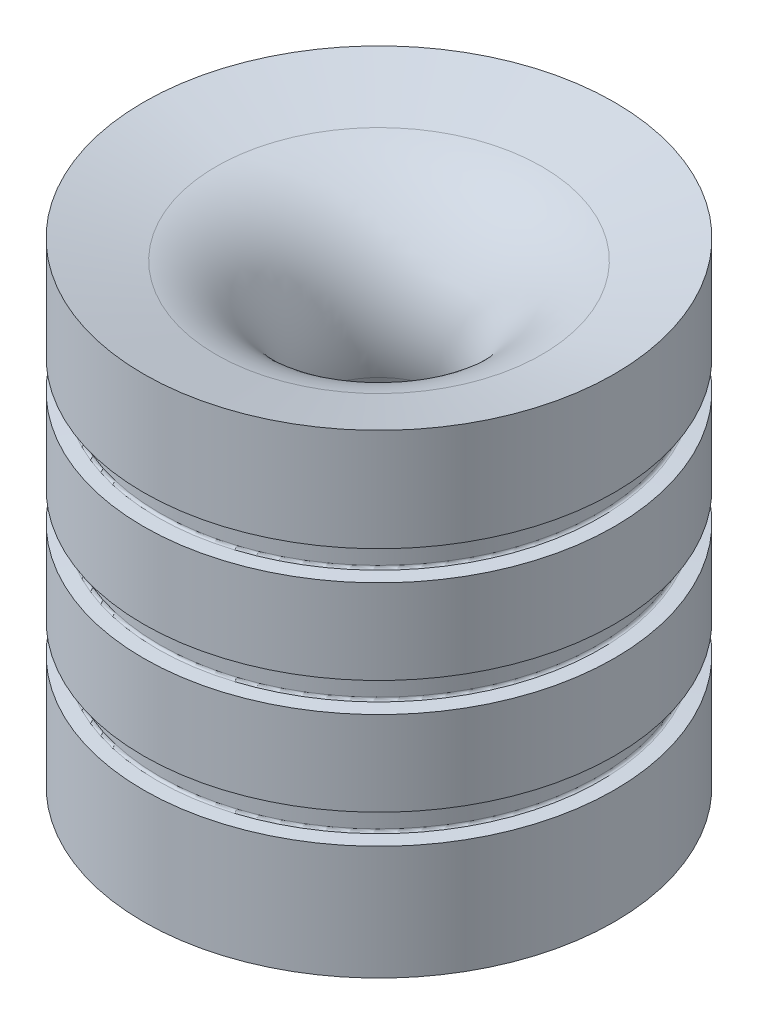
ISO-10303-21;
HEADER;
FILE_DESCRIPTION(('STEP AP214'),'2;1');
FILE_NAME('part.step','',(''),(''),'','','');
FILE_SCHEMA(('AUTOMOTIVE_DESIGN { 1 0 10303 214 1 1 1 1 }'));
ENDSEC;
DATA;
#1=APPLICATION_CONTEXT('core data for automotive mechanical design processes');
#2=APPLICATION_PROTOCOL_DEFINITION('international standard','automotive_design',2000,#1);
#3=PRODUCT_CONTEXT('',#1,'mechanical');
#4=PRODUCT('Part','Part','',(#3));
#5=PRODUCT_RELATED_PRODUCT_CATEGORY('part','',(#4));
#6=PRODUCT_DEFINITION_FORMATION('','',#4);
#7=PRODUCT_DEFINITION_CONTEXT('part definition',#1,'design');
#8=PRODUCT_DEFINITION('design','',#6,#7);
#9=PRODUCT_DEFINITION_SHAPE('','',#8);
#10=(LENGTH_UNIT() NAMED_UNIT(*) SI_UNIT(.MILLI.,.METRE.));
#11=(NAMED_UNIT(*) PLANE_ANGLE_UNIT() SI_UNIT($,.RADIAN.));
#12=(NAMED_UNIT(*) SI_UNIT($,.STERADIAN.) SOLID_ANGLE_UNIT());
#13=UNCERTAINTY_MEASURE_WITH_UNIT(LENGTH_MEASURE(1.E-05),#10,'distance_accuracy_value','');
#14=(GEOMETRIC_REPRESENTATION_CONTEXT(3) GLOBAL_UNCERTAINTY_ASSIGNED_CONTEXT((#13)) GLOBAL_UNIT_ASSIGNED_CONTEXT((#10,
#11,#12)) REPRESENTATION_CONTEXT('',''));
#15=CARTESIAN_POINT('',(0.,0.,0.));
#16=DIRECTION('',(0.,0.,1.));
#17=DIRECTION('',(1.,0.,0.));
#18=AXIS2_PLACEMENT_3D('',#15,#16,#17);
#19=CARTESIAN_POINT('',(0.,11.2038865741592,0.));
#20=DIRECTION('',(0.,-1.,0.));
#21=DIRECTION('',(0.,0.,-1.));
#22=AXIS2_PLACEMENT_3D('',#19,#20,#21);
#23=CYLINDRICAL_SURFACE('',#22,41.275);
#24=CARTESIAN_POINT('',(0.,60.0077777421875,0.));
#25=DIRECTION('',(0.,-1.,0.));
#26=DIRECTION('',(0.,0.,-1.));
#27=AXIS2_PLACEMENT_3D('',#24,#25,#26);
#28=CIRCLE('',#27,41.275);
#29=CARTESIAN_POINT('',(0.,60.0077777421875,-41.275));
#30=VERTEX_POINT('',#29);
#31=EDGE_CURVE('E40',#30,#30,#28,.F.);
#32=ORIENTED_EDGE('',*,*,#31,.F.);
#33=EDGE_LOOP('',(#32));
#34=FACE_BOUND('',#33,.T.);
#35=CARTESIAN_POINT('',(0.,45.1799101451754,0.));
#36=DIRECTION('',(0.,1.,0.));
#37=DIRECTION('',(0.,0.,1.));
#38=AXIS2_PLACEMENT_3D('',#35,#36,#37);
#39=CIRCLE('',#38,41.275);
#40=CARTESIAN_POINT('',(0.,45.1799101451754,41.275));
#41=VERTEX_POINT('',#40);
#42=EDGE_CURVE('E61',#41,#41,#39,.F.);
#43=ORIENTED_EDGE('',*,*,#42,.F.);
#44=EDGE_LOOP('',(#43));
#45=FACE_BOUND('',#44,.T.);
#46=ADVANCED_FACE('F36',(#34,#45),#23,.T.);
#47=CARTESIAN_POINT('',(0.,40.0077777421875,0.));
#48=DIRECTION('',(0.,-1.,0.));
#49=DIRECTION('',(0.,0.,-1.));
#50=AXIS2_PLACEMENT_3D('',#47,#48,#49);
#51=CIRCLE('',#50,41.275);
#52=CARTESIAN_POINT('',(0.,40.0077777421875,-41.275));
#53=VERTEX_POINT('',#52);
#54=EDGE_CURVE('E64',#53,#53,#51,.F.);
#55=ORIENTED_EDGE('',*,*,#54,.F.);
#56=EDGE_LOOP('',(#55));
#57=FACE_BOUND('',#56,.T.);
#58=CARTESIAN_POINT('',(0.,25.1799101451754,0.));
#59=DIRECTION('',(0.,1.,0.));
#60=DIRECTION('',(0.,0.,1.));
#61=AXIS2_PLACEMENT_3D('',#58,#59,#60);
#62=CIRCLE('',#61,41.275);
#63=CARTESIAN_POINT('',(0.,25.1799101451754,41.275));
#64=VERTEX_POINT('',#63);
#65=EDGE_CURVE('E53',#64,#64,#62,.F.);
#66=ORIENTED_EDGE('',*,*,#65,.F.);
#67=EDGE_LOOP('',(#66));
#68=FACE_BOUND('',#67,.T.);
#69=ADVANCED_FACE('F129',(#57,#68),#23,.T.);
#70=CARTESIAN_POINT('',(0.,20.0077777421875,0.));
#71=DIRECTION('',(0.,-1.,0.));
#72=DIRECTION('',(0.,0.,-1.));
#73=AXIS2_PLACEMENT_3D('',#70,#71,#72);
#74=CIRCLE('',#73,41.275);
#75=CARTESIAN_POINT('',(0.,20.0077777421875,-41.275));
#76=VERTEX_POINT('',#75);
#77=EDGE_CURVE('E56',#76,#76,#74,.F.);
#78=ORIENTED_EDGE('',*,*,#77,.F.);
#79=EDGE_LOOP('',(#78));
#80=FACE_BOUND('',#79,.T.);
#81=CARTESIAN_POINT('',(0.,0.,0.));
#82=DIRECTION('',(0.,-1.,0.));
#83=DIRECTION('',(0.,0.,-1.));
#84=AXIS2_PLACEMENT_3D('',#81,#82,#83);
#85=CIRCLE('',#84,41.275);
#86=CARTESIAN_POINT('',(0.,0.,-41.275));
#87=VERTEX_POINT('',#86);
#88=EDGE_CURVE('E44',#87,#87,#85,.T.);
#89=ORIENTED_EDGE('',*,*,#88,.F.);
#90=EDGE_LOOP('',(#89));
#91=FACE_BOUND('',#90,.T.);
#92=ADVANCED_FACE('F127',(#80,#91),#23,.T.);
#93=CARTESIAN_POINT('',(0.,83.16233102555,0.));
#94=DIRECTION('',(0.,1.,0.));
#95=DIRECTION('',(0.,0.,1.));
#96=AXIS2_PLACEMENT_3D('',#93,#94,#95);
#97=CONICAL_SURFACE('',#96,41.275,1.30899693899575);
#98=CARTESIAN_POINT('',(0.,79.7542801580591,0.));
#99=DIRECTION('',(0.,-1.,0.));
#100=DIRECTION('',(0.,0.,-1.));
#101=AXIS2_PLACEMENT_3D('',#98,#99,#100);
#102=CIRCLE('',#101,28.5559810077446);
#103=CARTESIAN_POINT('',(0.,79.7542801580591,-28.5559810077446));
#104=VERTEX_POINT('',#103);
#105=EDGE_CURVE('E60',#104,#104,#102,.T.);
#106=ORIENTED_EDGE('',*,*,#105,.T.);
#107=EDGE_LOOP('',(#106));
#108=FACE_BOUND('',#107,.T.);
#109=CARTESIAN_POINT('',(0.,83.16233102555,0.));
#110=DIRECTION('',(0.,-1.,0.));
#111=DIRECTION('',(0.,0.,-1.));
#112=AXIS2_PLACEMENT_3D('',#109,#110,#111);
#113=CIRCLE('',#112,41.275);
#114=CARTESIAN_POINT('',(0.,83.16233102555,-41.275));
#115=VERTEX_POINT('',#114);
#116=EDGE_CURVE('E10',#115,#115,#113,.T.);
#117=ORIENTED_EDGE('',*,*,#116,.F.);
#118=EDGE_LOOP('',(#117));
#119=FACE_BOUND('',#118,.T.);
#120=ADVANCED_FACE('F38',(#108,#119),#97,.F.);
#121=CARTESIAN_POINT('',(0.,65.1799101451754,0.));
#122=DIRECTION('',(0.,1.,0.));
#123=DIRECTION('',(0.,0.,1.));
#124=AXIS2_PLACEMENT_3D('',#121,#122,#123);
#125=CIRCLE('',#124,41.275);
#126=CARTESIAN_POINT('',(0.,65.1799101451754,41.275));
#127=VERTEX_POINT('',#126);
#128=EDGE_CURVE('E68',#127,#127,#125,.F.);
#129=ORIENTED_EDGE('',*,*,#128,.F.);
#130=EDGE_LOOP('',(#129));
#131=FACE_BOUND('',#130,.T.);
#132=ORIENTED_EDGE('',*,*,#116,.T.);
#133=EDGE_LOOP('',(#132));
#134=FACE_BOUND('',#133,.T.);
#135=ADVANCED_FACE('F117',(#131,#134),#23,.T.);
#136=CARTESIAN_POINT('',(41.275,0.,0.));
#137=DIRECTION('',(0.,-1.,0.));
#138=DIRECTION('',(0.,0.,-1.));
#139=AXIS2_PLACEMENT_3D('',#136,#137,#138);
#140=PLANE('',#139);
#141=ORIENTED_EDGE('',*,*,#88,.T.);
#142=EDGE_LOOP('',(#141));
#143=FACE_BOUND('',#142,.T.);
#144=CARTESIAN_POINT('',(0.,0.,0.));
#145=DIRECTION('',(0.,-1.,0.));
#146=DIRECTION('',(0.,0.,-1.));
#147=AXIS2_PLACEMENT_3D('',#144,#145,#146);
#148=CIRCLE('',#147,27.15);
#149=CARTESIAN_POINT('',(0.,0.,-27.15));
#150=VERTEX_POINT('',#149);
#151=EDGE_CURVE('E49',#150,#150,#148,.T.);
#152=ORIENTED_EDGE('',*,*,#151,.F.);
#153=EDGE_LOOP('',(#152));
#154=FACE_BOUND('',#153,.T.);
#155=ADVANCED_FACE('F115',(#143,#154),#140,.T.);
#156=CARTESIAN_POINT('',(0.,52.8098929874442,0.));
#157=DIRECTION('',(0.,-1.,0.));
#158=DIRECTION('',(0.,0.,-1.));
#159=AXIS2_PLACEMENT_3D('',#156,#157,#158);
#160=CONICAL_SURFACE('',#159,12.9996318216405,0.261799387799147);
#161=ORIENTED_EDGE('',*,*,#151,.T.);
#162=EDGE_LOOP('',(#161));
#163=FACE_BOUND('',#162,.T.);
#164=CARTESIAN_POINT('',(0.,52.8098929874442,0.));
#165=DIRECTION('',(0.,-1.,0.));
#166=DIRECTION('',(0.,0.,-1.));
#167=AXIS2_PLACEMENT_3D('',#164,#165,#166);
#168=CIRCLE('',#167,12.9996318216405);
#169=CARTESIAN_POINT('',(0.,52.8098929874442,-12.9996318216405));
#170=VERTEX_POINT('',#169);
#171=EDGE_CURVE('E107',#170,#170,#168,.T.);
#172=ORIENTED_EDGE('',*,*,#171,.F.);
#173=EDGE_LOOP('',(#172));
#174=FACE_BOUND('',#173,.T.);
#175=ADVANCED_FACE('F112',(#163,#174),#160,.F.);
#176=CARTESIAN_POINT('',(0.,58.5039119796996,0.));
#177=DIRECTION('',(0.,-1.,0.));
#178=DIRECTION('',(0.,0.,-1.));
#179=AXIS2_PLACEMENT_3D('',#176,#177,#178);
#180=TOROIDAL_SURFACE('',#179,34.25,22.);
#181=ORIENTED_EDGE('',*,*,#171,.T.);
#182=EDGE_LOOP('',(#181));
#183=FACE_BOUND('',#182,.T.);
#184=ORIENTED_EDGE('',*,*,#105,.F.);
#185=EDGE_LOOP('',(#184));
#186=FACE_BOUND('',#185,.T.);
#187=ADVANCED_FACE('F124',(#183,#186),#180,.T.);
#188=CARTESIAN_POINT('',(0.,20.6617524869832,0.));
#189=DIRECTION('',(0.,1.,0.));
#190=DIRECTION('',(0.,0.,1.));
#191=AXIS2_PLACEMENT_3D('',#188,#189,#190);
#192=TOROIDAL_SURFACE('',#191,38.9001,0.444499999999995);
#193=CARTESIAN_POINT('',(0.,20.6617524869832,0.));
#194=DIRECTION('',(0.,1.,0.));
#195=DIRECTION('',(0.,0.,1.));
#196=AXIS2_PLACEMENT_3D('',#193,#194,#195);
#197=CIRCLE('',#196,38.4556);
#198=CARTESIAN_POINT('',(0.,20.6617524869832,38.4556));
#199=VERTEX_POINT('',#198);
#200=EDGE_CURVE('E67',#199,#199,#197,.T.);
#201=ORIENTED_EDGE('',*,*,#200,.F.);
#202=EDGE_LOOP('',(#201));
#203=FACE_BOUND('',#202,.T.);
#204=CARTESIAN_POINT('',(0.,20.2189439436814,0.));
#205=DIRECTION('',(0.,1.,0.));
#206=DIRECTION('',(0.,0.,1.));
#207=AXIS2_PLACEMENT_3D('',#204,#205,#206);
#208=CIRCLE('',#207,38.8613592723487);
#209=CARTESIAN_POINT('',(0.,20.2189439436814,38.8613592723487));
#210=VERTEX_POINT('',#209);
#211=EDGE_CURVE('E57',#210,#210,#208,.T.);
#212=ORIENTED_EDGE('',*,*,#211,.T.);
#213=EDGE_LOOP('',(#212));
#214=FACE_BOUND('',#213,.T.);
#215=ADVANCED_FACE('F186',(#203,#214),#192,.F.);
#216=CARTESIAN_POINT('',(0.,20.,0.));
#217=DIRECTION('',(0.,-1.,0.));
#218=DIRECTION('',(0.,0.,-1.));
#219=AXIS2_PLACEMENT_3D('',#216,#217,#218);
#220=CONICAL_SURFACE('',#219,41.3639,1.48352986419518);
#221=ORIENTED_EDGE('',*,*,#77,.T.);
#222=EDGE_LOOP('',(#221));
#223=FACE_BOUND('',#222,.T.);
#224=ORIENTED_EDGE('',*,*,#211,.F.);
#225=EDGE_LOOP('',(#224));
#226=FACE_BOUND('',#225,.T.);
#227=ADVANCED_FACE('F182',(#223,#226),#220,.T.);
#228=CARTESIAN_POINT('',(0.,24.9687439436814,0.));
#229=DIRECTION('',(0.,1.,0.));
#230=DIRECTION('',(0.,0.,1.));
#231=AXIS2_PLACEMENT_3D('',#228,#229,#230);
#232=CONICAL_SURFACE('',#231,38.8613592723487,1.48352986419518);
#233=ORIENTED_EDGE('',*,*,#65,.T.);
#234=EDGE_LOOP('',(#233));
#235=FACE_BOUND('',#234,.T.);
#236=CARTESIAN_POINT('',(0.,24.9687439436814,0.));
#237=DIRECTION('',(0.,1.,0.));
#238=DIRECTION('',(0.,0.,1.));
#239=AXIS2_PLACEMENT_3D('',#236,#237,#238);
#240=CIRCLE('',#239,38.8613592723487);
#241=CARTESIAN_POINT('',(0.,24.9687439436814,38.8613592723487));
#242=VERTEX_POINT('',#241);
#243=EDGE_CURVE('E100',#242,#242,#240,.T.);
#244=ORIENTED_EDGE('',*,*,#243,.T.);
#245=EDGE_LOOP('',(#244));
#246=FACE_BOUND('',#245,.T.);
#247=ADVANCED_FACE('F178',(#235,#246),#232,.T.);
#248=CARTESIAN_POINT('',(0.,24.5259354003796,0.));
#249=DIRECTION('',(0.,1.,0.));
#250=DIRECTION('',(0.,0.,1.));
#251=AXIS2_PLACEMENT_3D('',#248,#249,#250);
#252=TOROIDAL_SURFACE('',#251,38.9001,0.4445);
#253=ORIENTED_EDGE('',*,*,#243,.F.);
#254=EDGE_LOOP('',(#253));
#255=FACE_BOUND('',#254,.T.);
#256=CARTESIAN_POINT('',(0.,24.5259354003796,0.));
#257=DIRECTION('',(0.,1.,0.));
#258=DIRECTION('',(0.,0.,1.));
#259=AXIS2_PLACEMENT_3D('',#256,#257,#258);
#260=CIRCLE('',#259,38.4556);
#261=CARTESIAN_POINT('',(0.,24.5259354003796,38.4556));
#262=VERTEX_POINT('',#261);
#263=EDGE_CURVE('E97',#262,#262,#260,.T.);
#264=ORIENTED_EDGE('',*,*,#263,.T.);
#265=EDGE_LOOP('',(#264));
#266=FACE_BOUND('',#265,.T.);
#267=ADVANCED_FACE('F174',(#255,#266),#252,.F.);
#268=CARTESIAN_POINT('',(0.,-38.7961134258408,0.));
#269=DIRECTION('',(0.,1.,0.));
#270=DIRECTION('',(0.,0.,1.));
#271=AXIS2_PLACEMENT_3D('',#268,#269,#270);
#272=CYLINDRICAL_SURFACE('',#271,38.4556);
#273=ORIENTED_EDGE('',*,*,#263,.F.);
#274=EDGE_LOOP('',(#273));
#275=FACE_BOUND('',#274,.T.);
#276=ORIENTED_EDGE('',*,*,#200,.T.);
#277=EDGE_LOOP('',(#276));
#278=FACE_BOUND('',#277,.T.);
#279=ADVANCED_FACE('F162',(#275,#278),#272,.T.);
#280=CARTESIAN_POINT('',(0.,40.6617524869832,0.));
#281=DIRECTION('',(0.,1.,0.));
#282=DIRECTION('',(0.,0.,1.));
#283=AXIS2_PLACEMENT_3D('',#280,#281,#282);
#284=TOROIDAL_SURFACE('',#283,38.9001,0.444499999999995);
#285=CARTESIAN_POINT('',(0.,40.6617524869832,0.));
#286=DIRECTION('',(0.,1.,0.));
#287=DIRECTION('',(0.,0.,1.));
#288=AXIS2_PLACEMENT_3D('',#285,#286,#287);
#289=CIRCLE('',#288,38.4556);
#290=CARTESIAN_POINT('',(0.,40.6617524869832,38.4556));
#291=VERTEX_POINT('',#290);
#292=EDGE_CURVE('E74',#291,#291,#289,.T.);
#293=ORIENTED_EDGE('',*,*,#292,.F.);
#294=EDGE_LOOP('',(#293));
#295=FACE_BOUND('',#294,.T.);
#296=CARTESIAN_POINT('',(0.,40.2189439436814,0.));
#297=DIRECTION('',(0.,1.,0.));
#298=DIRECTION('',(0.,0.,1.));
#299=AXIS2_PLACEMENT_3D('',#296,#297,#298);
#300=CIRCLE('',#299,38.8613592723487);
#301=CARTESIAN_POINT('',(0.,40.2189439436814,38.8613592723487));
#302=VERTEX_POINT('',#301);
#303=EDGE_CURVE('E65',#302,#302,#300,.T.);
#304=ORIENTED_EDGE('',*,*,#303,.T.);
#305=EDGE_LOOP('',(#304));
#306=FACE_BOUND('',#305,.T.);
#307=ADVANCED_FACE('F159',(#295,#306),#284,.F.);
#308=CARTESIAN_POINT('',(0.,40.,0.));
#309=DIRECTION('',(0.,-1.,0.));
#310=DIRECTION('',(0.,0.,-1.));
#311=AXIS2_PLACEMENT_3D('',#308,#309,#310);
#312=CONICAL_SURFACE('',#311,41.3639,1.48352986419518);
#313=ORIENTED_EDGE('',*,*,#54,.T.);
#314=EDGE_LOOP('',(#313));
#315=FACE_BOUND('',#314,.T.);
#316=ORIENTED_EDGE('',*,*,#303,.F.);
#317=EDGE_LOOP('',(#316));
#318=FACE_BOUND('',#317,.T.);
#319=ADVANCED_FACE('F143',(#315,#318),#312,.T.);
#320=CARTESIAN_POINT('',(0.,44.9687439436814,0.));
#321=DIRECTION('',(0.,1.,0.));
#322=DIRECTION('',(0.,0.,1.));
#323=AXIS2_PLACEMENT_3D('',#320,#321,#322);
#324=CONICAL_SURFACE('',#323,38.8613592723487,1.48352986419518);
#325=ORIENTED_EDGE('',*,*,#42,.T.);
#326=EDGE_LOOP('',(#325));
#327=FACE_BOUND('',#326,.T.);
#328=CARTESIAN_POINT('',(0.,44.9687439436814,0.));
#329=DIRECTION('',(0.,1.,0.));
#330=DIRECTION('',(0.,0.,1.));
#331=AXIS2_PLACEMENT_3D('',#328,#329,#330);
#332=CIRCLE('',#331,38.8613592723487);
#333=CARTESIAN_POINT('',(0.,44.9687439436814,38.8613592723487));
#334=VERTEX_POINT('',#333);
#335=EDGE_CURVE('E90',#334,#334,#332,.T.);
#336=ORIENTED_EDGE('',*,*,#335,.T.);
#337=EDGE_LOOP('',(#336));
#338=FACE_BOUND('',#337,.T.);
#339=ADVANCED_FACE('F139',(#327,#338),#324,.T.);
#340=CARTESIAN_POINT('',(0.,44.5259354003796,0.));
#341=DIRECTION('',(0.,1.,0.));
#342=DIRECTION('',(0.,0.,1.));
#343=AXIS2_PLACEMENT_3D('',#340,#341,#342);
#344=TOROIDAL_SURFACE('',#343,38.9001,0.4445);
#345=ORIENTED_EDGE('',*,*,#335,.F.);
#346=EDGE_LOOP('',(#345));
#347=FACE_BOUND('',#346,.T.);
#348=CARTESIAN_POINT('',(0.,44.5259354003796,0.));
#349=DIRECTION('',(0.,1.,0.));
#350=DIRECTION('',(0.,0.,1.));
#351=AXIS2_PLACEMENT_3D('',#348,#349,#350);
#352=CIRCLE('',#351,38.4556);
#353=CARTESIAN_POINT('',(0.,44.5259354003796,38.4556));
#354=VERTEX_POINT('',#353);
#355=EDGE_CURVE('E87',#354,#354,#352,.T.);
#356=ORIENTED_EDGE('',*,*,#355,.T.);
#357=EDGE_LOOP('',(#356));
#358=FACE_BOUND('',#357,.T.);
#359=ADVANCED_FACE('F142',(#347,#358),#344,.F.);
#360=CARTESIAN_POINT('',(0.,-18.7961134258408,0.));
#361=DIRECTION('',(0.,1.,0.));
#362=DIRECTION('',(0.,0.,1.));
#363=AXIS2_PLACEMENT_3D('',#360,#361,#362);
#364=CYLINDRICAL_SURFACE('',#363,38.4556);
#365=ORIENTED_EDGE('',*,*,#355,.F.);
#366=EDGE_LOOP('',(#365));
#367=FACE_BOUND('',#366,.T.);
#368=ORIENTED_EDGE('',*,*,#292,.T.);
#369=EDGE_LOOP('',(#368));
#370=FACE_BOUND('',#369,.T.);
#371=ADVANCED_FACE('F149',(#367,#370),#364,.T.);
#372=CARTESIAN_POINT('',(0.,60.6617524869832,0.));
#373=DIRECTION('',(0.,1.,0.));
#374=DIRECTION('',(0.,0.,1.));
#375=AXIS2_PLACEMENT_3D('',#372,#373,#374);
#376=TOROIDAL_SURFACE('',#375,38.9001,0.444499999999995);
#377=CARTESIAN_POINT('',(0.,60.6617524869832,0.));
#378=DIRECTION('',(0.,1.,0.));
#379=DIRECTION('',(0.,0.,1.));
#380=AXIS2_PLACEMENT_3D('',#377,#378,#379);
#381=CIRCLE('',#380,38.4556);
#382=CARTESIAN_POINT('',(0.,60.6617524869832,38.4556));
#383=VERTEX_POINT('',#382);
#384=EDGE_CURVE('E316',#383,#383,#381,.T.);
#385=ORIENTED_EDGE('',*,*,#384,.F.);
#386=EDGE_LOOP('',(#385));
#387=FACE_BOUND('',#386,.T.);
#388=CARTESIAN_POINT('',(0.,60.2189439436814,0.));
#389=DIRECTION('',(0.,1.,0.));
#390=DIRECTION('',(0.,0.,1.));
#391=AXIS2_PLACEMENT_3D('',#388,#389,#390);
#392=CIRCLE('',#391,38.8613592723487);
#393=CARTESIAN_POINT('',(0.,60.2189439436814,38.8613592723487));
#394=VERTEX_POINT('',#393);
#395=EDGE_CURVE('E70',#394,#394,#392,.T.);
#396=ORIENTED_EDGE('',*,*,#395,.T.);
#397=EDGE_LOOP('',(#396));
#398=FACE_BOUND('',#397,.T.);
#399=ADVANCED_FACE('F155',(#387,#398),#376,.F.);
#400=CARTESIAN_POINT('',(0.,60.,0.));
#401=DIRECTION('',(0.,-1.,0.));
#402=DIRECTION('',(0.,0.,-1.));
#403=AXIS2_PLACEMENT_3D('',#400,#401,#402);
#404=CONICAL_SURFACE('',#403,41.3639,1.48352986419518);
#405=ORIENTED_EDGE('',*,*,#31,.T.);
#406=EDGE_LOOP('',(#405));
#407=FACE_BOUND('',#406,.T.);
#408=ORIENTED_EDGE('',*,*,#395,.F.);
#409=EDGE_LOOP('',(#408));
#410=FACE_BOUND('',#409,.T.);
#411=ADVANCED_FACE('F268',(#407,#410),#404,.T.);
#412=CARTESIAN_POINT('',(0.,64.9687439436814,0.));
#413=DIRECTION('',(0.,1.,0.));
#414=DIRECTION('',(0.,0.,1.));
#415=AXIS2_PLACEMENT_3D('',#412,#413,#414);
#416=CONICAL_SURFACE('',#415,38.8613592723487,1.48352986419518);
#417=ORIENTED_EDGE('',*,*,#128,.T.);
#418=EDGE_LOOP('',(#417));
#419=FACE_BOUND('',#418,.T.);
#420=CARTESIAN_POINT('',(0.,64.9687439436814,0.));
#421=DIRECTION('',(0.,1.,0.));
#422=DIRECTION('',(0.,0.,1.));
#423=AXIS2_PLACEMENT_3D('',#420,#421,#422);
#424=CIRCLE('',#423,38.8613592723487);
#425=CARTESIAN_POINT('',(0.,64.9687439436814,38.8613592723487));
#426=VERTEX_POINT('',#425);
#427=EDGE_CURVE('E76',#426,#426,#424,.T.);
#428=ORIENTED_EDGE('',*,*,#427,.T.);
#429=EDGE_LOOP('',(#428));
#430=FACE_BOUND('',#429,.T.);
#431=ADVANCED_FACE('F278',(#419,#430),#416,.T.);
#432=CARTESIAN_POINT('',(0.,64.5259354003796,0.));
#433=DIRECTION('',(0.,1.,0.));
#434=DIRECTION('',(0.,0.,1.));
#435=AXIS2_PLACEMENT_3D('',#432,#433,#434);
#436=TOROIDAL_SURFACE('',#435,38.9001,0.4445);
#437=ORIENTED_EDGE('',*,*,#427,.F.);
#438=EDGE_LOOP('',(#437));
#439=FACE_BOUND('',#438,.T.);
#440=CARTESIAN_POINT('',(0.,64.5259354003796,0.));
#441=DIRECTION('',(0.,1.,0.));
#442=DIRECTION('',(0.,0.,1.));
#443=AXIS2_PLACEMENT_3D('',#440,#441,#442);
#444=CIRCLE('',#443,38.4556);
#445=CARTESIAN_POINT('',(0.,64.5259354003796,38.4556));
#446=VERTEX_POINT('',#445);
#447=EDGE_CURVE('E81',#446,#446,#444,.T.);
#448=ORIENTED_EDGE('',*,*,#447,.T.);
#449=EDGE_LOOP('',(#448));
#450=FACE_BOUND('',#449,.T.);
#451=ADVANCED_FACE('F288',(#439,#450),#436,.F.);
#452=CARTESIAN_POINT('',(0.,1.20388657415923,0.));
#453=DIRECTION('',(0.,1.,0.));
#454=DIRECTION('',(0.,0.,1.));
#455=AXIS2_PLACEMENT_3D('',#452,#453,#454);
#456=CYLINDRICAL_SURFACE('',#455,38.4556);
#457=ORIENTED_EDGE('',*,*,#447,.F.);
#458=EDGE_LOOP('',(#457));
#459=FACE_BOUND('',#458,.T.);
#460=ORIENTED_EDGE('',*,*,#384,.T.);
#461=EDGE_LOOP('',(#460));
#462=FACE_BOUND('',#461,.T.);
#463=ADVANCED_FACE('F297',(#459,#462),#456,.T.);
#464=CLOSED_SHELL('',(#46,#69,#92,#120,#135,#155,#175,#187,#215,#227,#247,#267,#279,#307,#319,
#339,#359,#371,#399,#411,#431,#451,#463));
#465=MANIFOLD_SOLID_BREP('B2',#464);
#466=ADVANCED_BREP_SHAPE_REPRESENTATION('',(#18,#465),#14);
#467=SHAPE_DEFINITION_REPRESENTATION(#9,#466);
ENDSEC;
END-ISO-10303-21;
